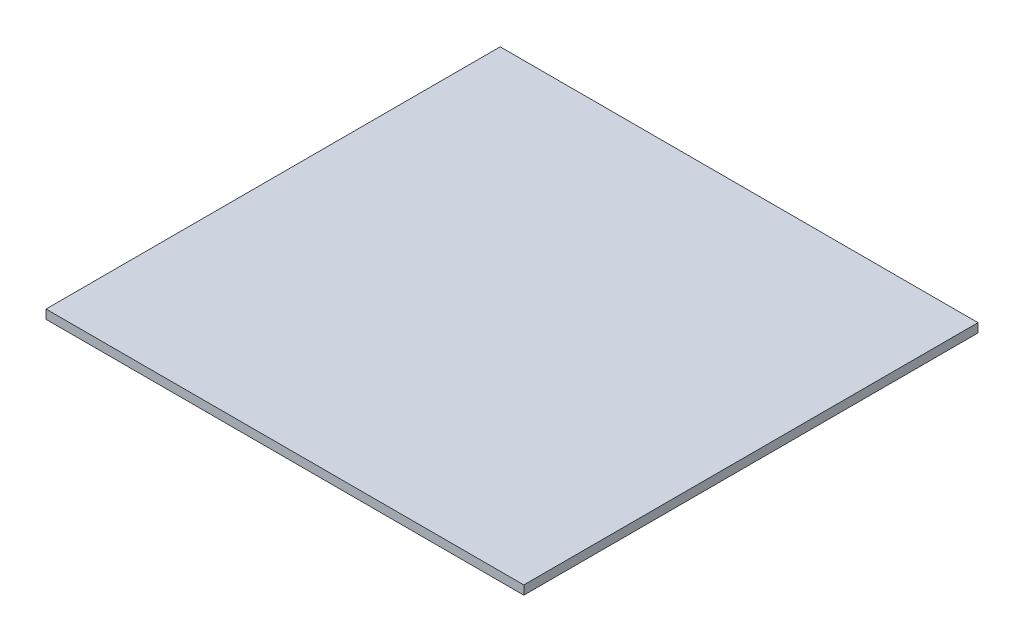
ISO-10303-21;
HEADER;
FILE_DESCRIPTION(('STEP AP214'),'2;1');
FILE_NAME('part.step','',(''),(''),'','','');
FILE_SCHEMA(('AUTOMOTIVE_DESIGN { 1 0 10303 214 1 1 1 1 }'));
ENDSEC;
DATA;
#1=APPLICATION_CONTEXT('core data for automotive mechanical design processes');
#2=APPLICATION_PROTOCOL_DEFINITION('international standard','automotive_design',2000,#1);
#3=PRODUCT_CONTEXT('',#1,'mechanical');
#4=PRODUCT('Part','Part','',(#3));
#5=PRODUCT_RELATED_PRODUCT_CATEGORY('part','',(#4));
#6=PRODUCT_DEFINITION_FORMATION('','',#4);
#7=PRODUCT_DEFINITION_CONTEXT('part definition',#1,'design');
#8=PRODUCT_DEFINITION('design','',#6,#7);
#9=PRODUCT_DEFINITION_SHAPE('','',#8);
#10=(LENGTH_UNIT() NAMED_UNIT(*) SI_UNIT(.MILLI.,.METRE.));
#11=(NAMED_UNIT(*) PLANE_ANGLE_UNIT() SI_UNIT($,.RADIAN.));
#12=(NAMED_UNIT(*) SI_UNIT($,.STERADIAN.) SOLID_ANGLE_UNIT());
#13=UNCERTAINTY_MEASURE_WITH_UNIT(LENGTH_MEASURE(1.E-05),#10,'distance_accuracy_value','');
#14=(GEOMETRIC_REPRESENTATION_CONTEXT(3) GLOBAL_UNCERTAINTY_ASSIGNED_CONTEXT((#13)) GLOBAL_UNIT_ASSIGNED_CONTEXT((#10,
#11,#12)) REPRESENTATION_CONTEXT('',''));
#15=CARTESIAN_POINT('',(0.,0.,0.));
#16=DIRECTION('',(0.,0.,1.));
#17=DIRECTION('',(1.,0.,0.));
#18=AXIS2_PLACEMENT_3D('',#15,#16,#17);
#19=CARTESIAN_POINT('',(91.,1.7,0.));
#20=DIRECTION('',(0.,0.,-1.));
#21=DIRECTION('',(-1.,0.,0.));
#22=AXIS2_PLACEMENT_3D('',#19,#20,#21);
#23=PLANE('',#22);
#24=DIRECTION('',(1.,0.,0.));
#25=VECTOR('',#24,1.);
#26=CARTESIAN_POINT('',(91.,0.,0.));
#27=LINE('',#26,#25);
#28=CARTESIAN_POINT('',(0.,0.,0.));
#29=VERTEX_POINT('',#28);
#30=CARTESIAN_POINT('',(91.,0.,0.));
#31=VERTEX_POINT('',#30);
#32=EDGE_CURVE('E97',#29,#31,#27,.T.);
#33=ORIENTED_EDGE('',*,*,#32,.T.);
#34=DIRECTION('',(0.,-1.,0.));
#35=VECTOR('',#34,1.);
#36=CARTESIAN_POINT('',(91.,1.7,0.));
#37=LINE('',#36,#35);
#38=CARTESIAN_POINT('',(91.,1.7,0.));
#39=VERTEX_POINT('',#38);
#40=EDGE_CURVE('E11',#39,#31,#37,.T.);
#41=ORIENTED_EDGE('',*,*,#40,.F.);
#42=DIRECTION('',(1.,0.,0.));
#43=VECTOR('',#42,1.);
#44=CARTESIAN_POINT('',(91.,1.7,0.));
#45=LINE('',#44,#43);
#46=CARTESIAN_POINT('',(0.,1.7,0.));
#47=VERTEX_POINT('',#46);
#48=EDGE_CURVE('E85',#47,#39,#45,.T.);
#49=ORIENTED_EDGE('',*,*,#48,.F.);
#50=DIRECTION('',(0.,-1.,0.));
#51=VECTOR('',#50,1.);
#52=CARTESIAN_POINT('',(0.,1.7,0.));
#53=LINE('',#52,#51);
#54=EDGE_CURVE('E93',#47,#29,#53,.T.);
#55=ORIENTED_EDGE('',*,*,#54,.T.);
#56=EDGE_LOOP('',(#33,#41,#49,#55));
#57=FACE_BOUND('',#56,.T.);
#58=ADVANCED_FACE('F34',(#57),#23,.F.);
#59=CARTESIAN_POINT('',(91.,1.7,-86.5));
#60=DIRECTION('',(-1.,0.,0.));
#61=DIRECTION('',(0.,0.,1.));
#62=AXIS2_PLACEMENT_3D('',#59,#60,#61);
#63=PLANE('',#62);
#64=DIRECTION('',(0.,0.,-1.));
#65=VECTOR('',#64,1.);
#66=CARTESIAN_POINT('',(91.,0.,-86.5));
#67=LINE('',#66,#65);
#68=CARTESIAN_POINT('',(91.,0.,-86.5));
#69=VERTEX_POINT('',#68);
#70=EDGE_CURVE('E89',#31,#69,#67,.T.);
#71=ORIENTED_EDGE('',*,*,#70,.T.);
#72=DIRECTION('',(0.,-1.,0.));
#73=VECTOR('',#72,1.);
#74=CARTESIAN_POINT('',(91.,1.7,-86.5));
#75=LINE('',#74,#73);
#76=CARTESIAN_POINT('',(91.,1.7,-86.5));
#77=VERTEX_POINT('',#76);
#78=EDGE_CURVE('E42',#77,#69,#75,.T.);
#79=ORIENTED_EDGE('',*,*,#78,.F.);
#80=DIRECTION('',(0.,0.,-1.));
#81=VECTOR('',#80,1.);
#82=CARTESIAN_POINT('',(91.,1.7,-86.5));
#83=LINE('',#82,#81);
#84=EDGE_CURVE('E80',#39,#77,#83,.T.);
#85=ORIENTED_EDGE('',*,*,#84,.F.);
#86=ORIENTED_EDGE('',*,*,#40,.T.);
#87=EDGE_LOOP('',(#71,#79,#85,#86));
#88=FACE_BOUND('',#87,.T.);
#89=ADVANCED_FACE('F88',(#88),#63,.F.);
#90=CARTESIAN_POINT('',(0.,1.7,-86.5));
#91=DIRECTION('',(0.,0.,1.));
#92=DIRECTION('',(1.,0.,0.));
#93=AXIS2_PLACEMENT_3D('',#90,#91,#92);
#94=PLANE('',#93);
#95=DIRECTION('',(-1.,0.,0.));
#96=VECTOR('',#95,1.);
#97=CARTESIAN_POINT('',(0.,0.,-86.5));
#98=LINE('',#97,#96);
#99=CARTESIAN_POINT('',(0.,0.,-86.5));
#100=VERTEX_POINT('',#99);
#101=EDGE_CURVE('E67',#69,#100,#98,.T.);
#102=ORIENTED_EDGE('',*,*,#101,.T.);
#103=DIRECTION('',(0.,-1.,0.));
#104=VECTOR('',#103,1.);
#105=CARTESIAN_POINT('',(0.,1.7,-86.5));
#106=LINE('',#105,#104);
#107=CARTESIAN_POINT('',(0.,1.7,-86.5));
#108=VERTEX_POINT('',#107);
#109=EDGE_CURVE('E90',#108,#100,#106,.T.);
#110=ORIENTED_EDGE('',*,*,#109,.F.);
#111=DIRECTION('',(-1.,0.,0.));
#112=VECTOR('',#111,1.);
#113=CARTESIAN_POINT('',(0.,1.7,-86.5));
#114=LINE('',#113,#112);
#115=EDGE_CURVE('E83',#77,#108,#114,.T.);
#116=ORIENTED_EDGE('',*,*,#115,.F.);
#117=ORIENTED_EDGE('',*,*,#78,.T.);
#118=EDGE_LOOP('',(#102,#110,#116,#117));
#119=FACE_BOUND('',#118,.T.);
#120=ADVANCED_FACE('F91',(#119),#94,.F.);
#121=CARTESIAN_POINT('',(0.,1.7,0.));
#122=DIRECTION('',(1.,0.,0.));
#123=DIRECTION('',(0.,0.,-1.));
#124=AXIS2_PLACEMENT_3D('',#121,#122,#123);
#125=PLANE('',#124);
#126=DIRECTION('',(0.,0.,1.));
#127=VECTOR('',#126,1.);
#128=CARTESIAN_POINT('',(0.,0.,0.));
#129=LINE('',#128,#127);
#130=EDGE_CURVE('E73',#100,#29,#129,.T.);
#131=ORIENTED_EDGE('',*,*,#130,.T.);
#132=ORIENTED_EDGE('',*,*,#54,.F.);
#133=DIRECTION('',(0.,0.,1.));
#134=VECTOR('',#133,1.);
#135=CARTESIAN_POINT('',(0.,1.7,0.));
#136=LINE('',#135,#134);
#137=EDGE_CURVE('E50',#108,#47,#136,.T.);
#138=ORIENTED_EDGE('',*,*,#137,.F.);
#139=ORIENTED_EDGE('',*,*,#109,.T.);
#140=EDGE_LOOP('',(#131,#132,#138,#139));
#141=FACE_BOUND('',#140,.T.);
#142=ADVANCED_FACE('F104',(#141),#125,.F.);
#143=CARTESIAN_POINT('',(0.,1.7,0.));
#144=DIRECTION('',(0.,-1.,0.));
#145=DIRECTION('',(0.,0.,-1.));
#146=AXIS2_PLACEMENT_3D('',#143,#144,#145);
#147=PLANE('',#146);
#148=ORIENTED_EDGE('',*,*,#48,.T.);
#149=ORIENTED_EDGE('',*,*,#84,.T.);
#150=ORIENTED_EDGE('',*,*,#115,.T.);
#151=ORIENTED_EDGE('',*,*,#137,.T.);
#152=EDGE_LOOP('',(#148,#149,#150,#151));
#153=FACE_BOUND('',#152,.T.);
#154=ADVANCED_FACE('F81',(#153),#147,.F.);
#155=CARTESIAN_POINT('',(0.,0.,0.));
#156=DIRECTION('',(0.,-1.,0.));
#157=DIRECTION('',(0.,0.,-1.));
#158=AXIS2_PLACEMENT_3D('',#155,#156,#157);
#159=PLANE('',#158);
#160=ORIENTED_EDGE('',*,*,#32,.F.);
#161=ORIENTED_EDGE('',*,*,#130,.F.);
#162=ORIENTED_EDGE('',*,*,#101,.F.);
#163=ORIENTED_EDGE('',*,*,#70,.F.);
#164=EDGE_LOOP('',(#160,#161,#162,#163));
#165=FACE_BOUND('',#164,.T.);
#166=ADVANCED_FACE('F107',(#165),#159,.T.);
#167=CLOSED_SHELL('',(#58,#89,#120,#142,#154,#166));
#168=MANIFOLD_SOLID_BREP('B2',#167);
#169=ADVANCED_BREP_SHAPE_REPRESENTATION('',(#18,#168),#14);
#170=SHAPE_DEFINITION_REPRESENTATION(#9,#169);
ENDSEC;
END-ISO-10303-21;
